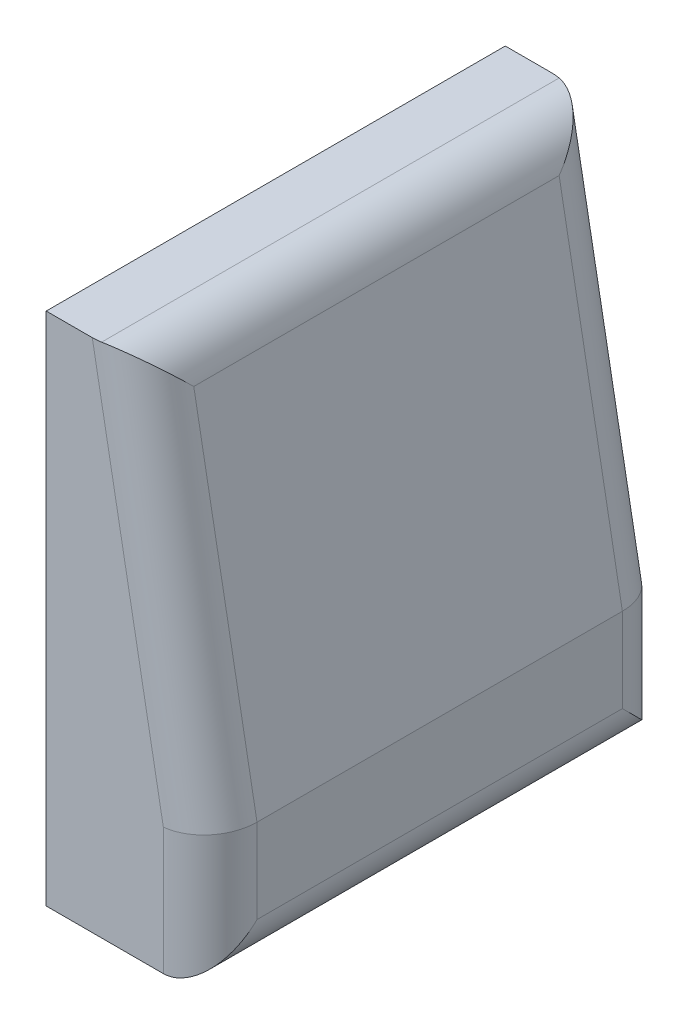
ISO-10303-21;
HEADER;
FILE_DESCRIPTION(('STEP AP214'),'2;1');
FILE_NAME('part.step','',(''),(''),'','','');
FILE_SCHEMA(('AUTOMOTIVE_DESIGN { 1 0 10303 214 1 1 1 1 }'));
ENDSEC;
DATA;
#1=APPLICATION_CONTEXT('core data for automotive mechanical design processes');
#2=APPLICATION_PROTOCOL_DEFINITION('international standard','automotive_design',2000,#1);
#3=PRODUCT_CONTEXT('',#1,'mechanical');
#4=PRODUCT('Part','Part','',(#3));
#5=PRODUCT_RELATED_PRODUCT_CATEGORY('part','',(#4));
#6=PRODUCT_DEFINITION_FORMATION('','',#4);
#7=PRODUCT_DEFINITION_CONTEXT('part definition',#1,'design');
#8=PRODUCT_DEFINITION('design','',#6,#7);
#9=PRODUCT_DEFINITION_SHAPE('','',#8);
#10=(LENGTH_UNIT() NAMED_UNIT(*) SI_UNIT(.MILLI.,.METRE.));
#11=(NAMED_UNIT(*) PLANE_ANGLE_UNIT() SI_UNIT($,.RADIAN.));
#12=(NAMED_UNIT(*) SI_UNIT($,.STERADIAN.) SOLID_ANGLE_UNIT());
#13=UNCERTAINTY_MEASURE_WITH_UNIT(LENGTH_MEASURE(1.E-05),#10,'distance_accuracy_value','');
#14=(GEOMETRIC_REPRESENTATION_CONTEXT(3) GLOBAL_UNCERTAINTY_ASSIGNED_CONTEXT((#13)) GLOBAL_UNIT_ASSIGNED_CONTEXT((#10,
#11,#12)) REPRESENTATION_CONTEXT('',''));
#15=CARTESIAN_POINT('',(0.,0.,0.));
#16=DIRECTION('',(0.,0.,1.));
#17=DIRECTION('',(1.,0.,0.));
#18=AXIS2_PLACEMENT_3D('',#15,#16,#17);
#19=CARTESIAN_POINT('',(350.,0.,490.));
#20=DIRECTION('',(0.,1.,0.));
#21=DIRECTION('',(-1.,0.,0.));
#22=AXIS2_PLACEMENT_3D('',#19,#20,#21);
#23=PLANE('',#22);
#24=DIRECTION('',(1.,0.,0.));
#25=VECTOR('',#24,1.);
#26=CARTESIAN_POINT('',(350.,0.,-490.));
#27=LINE('',#26,#25);
#28=CARTESIAN_POINT('',(0.,0.,-490.));
#29=VERTEX_POINT('',#28);
#30=CARTESIAN_POINT('',(250.,0.,-490.));
#31=VERTEX_POINT('',#30);
#32=EDGE_CURVE('E146',#29,#31,#27,.T.);
#33=ORIENTED_EDGE('',*,*,#32,.T.);
#34=DIRECTION('',(0.,0.,-1.));
#35=VECTOR('',#34,1.);
#36=CARTESIAN_POINT('',(250.,0.,490.));
#37=LINE('',#36,#35);
#38=CARTESIAN_POINT('',(250.,0.,490.));
#39=VERTEX_POINT('',#38);
#40=EDGE_CURVE('E168',#31,#39,#37,.F.);
#41=ORIENTED_EDGE('',*,*,#40,.T.);
#42=DIRECTION('',(1.,0.,0.));
#43=VECTOR('',#42,1.);
#44=CARTESIAN_POINT('',(350.,0.,490.));
#45=LINE('',#44,#43);
#46=CARTESIAN_POINT('',(0.,0.,490.));
#47=VERTEX_POINT('',#46);
#48=EDGE_CURVE('E125',#47,#39,#45,.T.);
#49=ORIENTED_EDGE('',*,*,#48,.F.);
#50=DIRECTION('',(0.,0.,-1.));
#51=VECTOR('',#50,1.);
#52=CARTESIAN_POINT('',(0.,0.,490.));
#53=LINE('',#52,#51);
#54=EDGE_CURVE('E135',#47,#29,#53,.T.);
#55=ORIENTED_EDGE('',*,*,#54,.T.);
#56=EDGE_LOOP('',(#33,#41,#49,#55));
#57=FACE_BOUND('',#56,.T.);
#58=ADVANCED_FACE('F41',(#57),#23,.F.);
#59=CARTESIAN_POINT('',(350.,280.,490.));
#60=DIRECTION('',(-1.,0.,0.));
#61=DIRECTION('',(0.,0.,1.));
#62=AXIS2_PLACEMENT_3D('',#59,#60,#61);
#63=PLANE('',#62);
#64=DIRECTION('',(0.,0.,-1.));
#65=VECTOR('',#64,1.);
#66=CARTESIAN_POINT('',(350.,280.,490.));
#67=LINE('',#66,#65);
#68=CARTESIAN_POINT('',(350.,280.,390.));
#69=VERTEX_POINT('',#68);
#70=CARTESIAN_POINT('',(350.,280.,-390.));
#71=VERTEX_POINT('',#70);
#72=EDGE_CURVE('E134',#69,#71,#67,.T.);
#73=ORIENTED_EDGE('',*,*,#72,.F.);
#74=DIRECTION('',(0.,1.,0.));
#75=VECTOR('',#74,1.);
#76=CARTESIAN_POINT('',(350.,280.,390.));
#77=LINE('',#76,#75);
#78=CARTESIAN_POINT('',(350.,100.,390.));
#79=VERTEX_POINT('',#78);
#80=EDGE_CURVE('E165',#69,#79,#77,.F.);
#81=ORIENTED_EDGE('',*,*,#80,.T.);
#82=DIRECTION('',(0.,0.,-1.));
#83=VECTOR('',#82,1.);
#84=CARTESIAN_POINT('',(350.,100.,490.));
#85=LINE('',#84,#83);
#86=CARTESIAN_POINT('',(350.,100.,-390.));
#87=VERTEX_POINT('',#86);
#88=EDGE_CURVE('E161',#79,#87,#85,.T.);
#89=ORIENTED_EDGE('',*,*,#88,.T.);
#90=DIRECTION('',(0.,1.,0.));
#91=VECTOR('',#90,1.);
#92=CARTESIAN_POINT('',(350.,280.,-390.));
#93=LINE('',#92,#91);
#94=EDGE_CURVE('E158',#87,#71,#93,.T.);
#95=ORIENTED_EDGE('',*,*,#94,.T.);
#96=EDGE_LOOP('',(#73,#81,#89,#95));
#97=FACE_BOUND('',#96,.T.);
#98=ADVANCED_FACE('F244',(#97),#63,.F.);
#99=CARTESIAN_POINT('',(200.,1100.,490.));
#100=DIRECTION('',(-0.983677406707226,-0.17994098903181,0.));
#101=DIRECTION('',(0.17994098903181,-0.983677406707226,0.));
#102=AXIS2_PLACEMENT_3D('',#99,#100,#101);
#103=PLANE('',#102);
#104=DIRECTION('',(0.,0.,-1.));
#105=VECTOR('',#104,1.);
#106=CARTESIAN_POINT('',(215.00107946893,1017.99409890318,490.));
#107=LINE('',#106,#105);
#108=CARTESIAN_POINT('',(215.00107946893,1017.99409890318,-390.));
#109=VERTEX_POINT('',#108);
#110=CARTESIAN_POINT('',(215.00107946893,1017.99409890318,390.));
#111=VERTEX_POINT('',#110);
#112=EDGE_CURVE('E65',#109,#111,#107,.F.);
#113=ORIENTED_EDGE('',*,*,#112,.T.);
#114=DIRECTION('',(-0.17994098903181,0.983677406707226,0.));
#115=VECTOR('',#114,1.);
#116=CARTESIAN_POINT('',(200.,1100.,390.));
#117=LINE('',#116,#115);
#118=EDGE_CURVE('E191',#111,#69,#117,.F.);
#119=ORIENTED_EDGE('',*,*,#118,.T.);
#120=ORIENTED_EDGE('',*,*,#72,.T.);
#121=DIRECTION('',(-0.17994098903181,0.983677406707226,0.));
#122=VECTOR('',#121,1.);
#123=CARTESIAN_POINT('',(200.,1100.,-390.));
#124=LINE('',#123,#122);
#125=EDGE_CURVE('E186',#71,#109,#124,.T.);
#126=ORIENTED_EDGE('',*,*,#125,.T.);
#127=EDGE_LOOP('',(#113,#119,#120,#126));
#128=FACE_BOUND('',#127,.T.);
#129=ADVANCED_FACE('F245',(#128),#103,.F.);
#130=CARTESIAN_POINT('',(0.,1100.,490.));
#131=DIRECTION('',(0.,-1.,0.));
#132=DIRECTION('',(0.,0.,-1.));
#133=AXIS2_PLACEMENT_3D('',#130,#131,#132);
#134=PLANE('',#133);
#135=DIRECTION('',(-1.,0.,0.));
#136=VECTOR('',#135,1.);
#137=CARTESIAN_POINT('',(0.,1100.,490.));
#138=LINE('',#137,#136);
#139=CARTESIAN_POINT('',(98.3406558713784,1100.,490.));
#140=VERTEX_POINT('',#139);
#141=CARTESIAN_POINT('',(0.,1100.,490.));
#142=VERTEX_POINT('',#141);
#143=EDGE_CURVE('E113',#140,#142,#138,.T.);
#144=ORIENTED_EDGE('',*,*,#143,.F.);
#145=CARTESIAN_POINT('',(98.3406558713784,1100.,390.));
#146=DIRECTION('',(0.,-1.,0.));
#147=DIRECTION('',(-1.,0.,0.));
#148=AXIS2_PLACEMENT_3D('',#145,#146,#147);
#149=ELLIPSE('',#148,101.659344128622,100.);
#150=CARTESIAN_POINT('',(116.633338798208,1100.,488.367740670723));
#151=VERTEX_POINT('',#150);
#152=EDGE_CURVE('E183',#140,#151,#149,.F.);
#153=ORIENTED_EDGE('',*,*,#152,.T.);
#154=DIRECTION('',(0.,0.,-1.));
#155=VECTOR('',#154,1.);
#156=CARTESIAN_POINT('',(116.633338798208,1100.,490.));
#157=LINE('',#156,#155);
#158=CARTESIAN_POINT('',(116.633338798208,1100.,-488.367740670723));
#159=VERTEX_POINT('',#158);
#160=EDGE_CURVE('E180',#151,#159,#157,.T.);
#161=ORIENTED_EDGE('',*,*,#160,.T.);
#162=CARTESIAN_POINT('',(98.3406558713784,1100.,-390.));
#163=DIRECTION('',(0.,-1.,0.));
#164=DIRECTION('',(1.,0.,0.));
#165=AXIS2_PLACEMENT_3D('',#162,#163,#164);
#166=ELLIPSE('',#165,101.659344128622,100.);
#167=CARTESIAN_POINT('',(98.3406558713784,1100.,-490.));
#168=VERTEX_POINT('',#167);
#169=EDGE_CURVE('E177',#159,#168,#166,.F.);
#170=ORIENTED_EDGE('',*,*,#169,.T.);
#171=DIRECTION('',(-1.,0.,0.));
#172=VECTOR('',#171,1.);
#173=CARTESIAN_POINT('',(0.,1100.,-490.));
#174=LINE('',#173,#172);
#175=CARTESIAN_POINT('',(0.,1100.,-490.));
#176=VERTEX_POINT('',#175);
#177=EDGE_CURVE('E130',#168,#176,#174,.T.);
#178=ORIENTED_EDGE('',*,*,#177,.T.);
#179=DIRECTION('',(0.,0.,-1.));
#180=VECTOR('',#179,1.);
#181=CARTESIAN_POINT('',(0.,1100.,490.));
#182=LINE('',#181,#180);
#183=EDGE_CURVE('E128',#142,#176,#182,.T.);
#184=ORIENTED_EDGE('',*,*,#183,.F.);
#185=EDGE_LOOP('',(#144,#153,#161,#170,#178,#184));
#186=FACE_BOUND('',#185,.T.);
#187=ADVANCED_FACE('F129',(#186),#134,.F.);
#188=CARTESIAN_POINT('',(0.,0.,490.));
#189=DIRECTION('',(1.,0.,0.));
#190=DIRECTION('',(0.,0.,-1.));
#191=AXIS2_PLACEMENT_3D('',#188,#189,#190);
#192=PLANE('',#191);
#193=DIRECTION('',(0.,-1.,0.));
#194=VECTOR('',#193,1.);
#195=CARTESIAN_POINT('',(0.,0.,-490.));
#196=LINE('',#195,#194);
#197=EDGE_CURVE('E152',#176,#29,#196,.T.);
#198=ORIENTED_EDGE('',*,*,#197,.T.);
#199=ORIENTED_EDGE('',*,*,#54,.F.);
#200=DIRECTION('',(0.,-1.,0.));
#201=VECTOR('',#200,1.);
#202=CARTESIAN_POINT('',(0.,0.,490.));
#203=LINE('',#202,#201);
#204=EDGE_CURVE('E118',#142,#47,#203,.T.);
#205=ORIENTED_EDGE('',*,*,#204,.F.);
#206=ORIENTED_EDGE('',*,*,#183,.T.);
#207=EDGE_LOOP('',(#198,#199,#205,#206));
#208=FACE_BOUND('',#207,.T.);
#209=ADVANCED_FACE('F137',(#208),#192,.F.);
#210=CARTESIAN_POINT('',(0.,0.,490.));
#211=DIRECTION('',(0.,0.,-1.));
#212=DIRECTION('',(-1.,0.,0.));
#213=AXIS2_PLACEMENT_3D('',#210,#211,#212);
#214=PLANE('',#213);
#215=DIRECTION('',(0.,1.,0.));
#216=VECTOR('',#215,1.);
#217=CARTESIAN_POINT('',(250.,0.,490.));
#218=LINE('',#217,#216);
#219=CARTESIAN_POINT('',(250.,270.928918763536,490.));
#220=VERTEX_POINT('',#219);
#221=EDGE_CURVE('E172',#39,#220,#218,.T.);
#222=ORIENTED_EDGE('',*,*,#221,.T.);
#223=DIRECTION('',(-0.17994098903181,0.983677406707226,0.));
#224=VECTOR('',#223,1.);
#225=CARTESIAN_POINT('',(289.860781418787,53.0233136741683,490.));
#226=LINE('',#225,#224);
#227=EDGE_CURVE('E121',#220,#140,#226,.T.);
#228=ORIENTED_EDGE('',*,*,#227,.T.);
#229=ORIENTED_EDGE('',*,*,#143,.T.);
#230=ORIENTED_EDGE('',*,*,#204,.T.);
#231=ORIENTED_EDGE('',*,*,#48,.T.);
#232=EDGE_LOOP('',(#222,#228,#229,#230,#231));
#233=FACE_BOUND('',#232,.T.);
#234=ADVANCED_FACE('F115',(#233),#214,.F.);
#235=CARTESIAN_POINT('',(0.,0.,-490.));
#236=DIRECTION('',(0.,0.,-1.));
#237=DIRECTION('',(-1.,0.,0.));
#238=AXIS2_PLACEMENT_3D('',#235,#236,#237);
#239=PLANE('',#238);
#240=ORIENTED_EDGE('',*,*,#177,.F.);
#241=DIRECTION('',(-0.17994098903181,0.983677406707226,0.));
#242=VECTOR('',#241,1.);
#243=CARTESIAN_POINT('',(251.632259329277,262.005901096819,-490.));
#244=LINE('',#243,#242);
#245=CARTESIAN_POINT('',(250.,270.928918763535,-490.));
#246=VERTEX_POINT('',#245);
#247=EDGE_CURVE('E11',#168,#246,#244,.F.);
#248=ORIENTED_EDGE('',*,*,#247,.T.);
#249=DIRECTION('',(0.,1.,0.));
#250=VECTOR('',#249,1.);
#251=CARTESIAN_POINT('',(250.,0.,-490.));
#252=LINE('',#251,#250);
#253=EDGE_CURVE('E51',#246,#31,#252,.F.);
#254=ORIENTED_EDGE('',*,*,#253,.T.);
#255=ORIENTED_EDGE('',*,*,#32,.F.);
#256=ORIENTED_EDGE('',*,*,#197,.F.);
#257=EDGE_LOOP('',(#240,#248,#254,#255,#256));
#258=FACE_BOUND('',#257,.T.);
#259=ADVANCED_FACE('F224',(#258),#239,.T.);
#260=CARTESIAN_POINT('',(116.633338798208,1000.,490.));
#261=DIRECTION('',(0.,0.,-1.));
#262=DIRECTION('',(-1.,0.,0.));
#263=AXIS2_PLACEMENT_3D('',#260,#261,#262);
#264=CYLINDRICAL_SURFACE('',#263,100.);
#265=CARTESIAN_POINT('',(116.633338798208,1000.,-390.));
#266=DIRECTION('',(0.127237493557807,-0.695564964782677,-0.707106781186547));
#267=DIRECTION('',(0.127237493557807,-0.695564964782677,0.707106781186547));
#268=AXIS2_PLACEMENT_3D('',#265,#266,#267);
#269=ELLIPSE('',#268,141.42135623731,100.);
#270=EDGE_CURVE('E209',#159,#109,#269,.T.);
#271=ORIENTED_EDGE('',*,*,#270,.F.);
#272=ORIENTED_EDGE('',*,*,#160,.F.);
#273=CARTESIAN_POINT('',(116.633338798208,1000.,390.));
#274=DIRECTION('',(-0.127237493557807,0.695564964782677,-0.707106781186547));
#275=DIRECTION('',(0.127237493557807,-0.695564964782677,-0.707106781186547));
#276=AXIS2_PLACEMENT_3D('',#273,#274,#275);
#277=ELLIPSE('',#276,141.42135623731,100.);
#278=EDGE_CURVE('E45',#111,#151,#277,.F.);
#279=ORIENTED_EDGE('',*,*,#278,.F.);
#280=ORIENTED_EDGE('',*,*,#112,.F.);
#281=EDGE_LOOP('',(#271,#272,#279,#280));
#282=FACE_BOUND('',#281,.T.);
#283=ADVANCED_FACE('F43',(#282),#264,.T.);
#284=CARTESIAN_POINT('',(289.860781418787,53.0233136741683,390.));
#285=DIRECTION('',(-0.17994098903181,0.983677406707226,0.));
#286=DIRECTION('',(-0.983677406707226,-0.17994098903181,0.));
#287=AXIS2_PLACEMENT_3D('',#284,#285,#286);
#288=CYLINDRICAL_SURFACE('',#287,100.);
#289=ORIENTED_EDGE('',*,*,#152,.F.);
#290=ORIENTED_EDGE('',*,*,#227,.F.);
#291=CARTESIAN_POINT('',(250.,270.928918763536,390.));
#292=DIRECTION('',(-0.0903398950983827,0.995910991682296,0.));
#293=DIRECTION('',(0.995910991682295,0.0903398950983824,0.));
#294=AXIS2_PLACEMENT_3D('',#291,#292,#293);
#295=ELLIPSE('',#294,100.410579695561,100.);
#296=EDGE_CURVE('E206',#69,#220,#295,.F.);
#297=ORIENTED_EDGE('',*,*,#296,.F.);
#298=ORIENTED_EDGE('',*,*,#118,.F.);
#299=ORIENTED_EDGE('',*,*,#278,.T.);
#300=EDGE_LOOP('',(#289,#290,#297,#298,#299));
#301=FACE_BOUND('',#300,.T.);
#302=ADVANCED_FACE('F220',(#301),#288,.T.);
#303=CARTESIAN_POINT('',(101.632259329277,1082.00590109682,-390.));
#304=DIRECTION('',(0.17994098903181,-0.983677406707226,0.));
#305=DIRECTION('',(0.983677406707226,0.17994098903181,0.));
#306=AXIS2_PLACEMENT_3D('',#303,#304,#305);
#307=CYLINDRICAL_SURFACE('',#306,100.);
#308=ORIENTED_EDGE('',*,*,#270,.T.);
#309=ORIENTED_EDGE('',*,*,#125,.F.);
#310=CARTESIAN_POINT('',(250.,270.928918763531,-390.));
#311=DIRECTION('',(0.0903398950983827,-0.995910991682296,0.));
#312=DIRECTION('',(-0.995910991682295,-0.0903398950983824,0.));
#313=AXIS2_PLACEMENT_3D('',#310,#311,#312);
#314=ELLIPSE('',#313,100.410579695561,100.);
#315=EDGE_CURVE('E202',#246,#71,#314,.T.);
#316=ORIENTED_EDGE('',*,*,#315,.F.);
#317=ORIENTED_EDGE('',*,*,#247,.F.);
#318=ORIENTED_EDGE('',*,*,#169,.F.);
#319=EDGE_LOOP('',(#308,#309,#316,#317,#318));
#320=FACE_BOUND('',#319,.T.);
#321=ADVANCED_FACE('F226',(#320),#307,.T.);
#322=CARTESIAN_POINT('',(250.,0.,390.));
#323=DIRECTION('',(0.,1.,0.));
#324=DIRECTION('',(0.,0.,1.));
#325=AXIS2_PLACEMENT_3D('',#322,#323,#324);
#326=CYLINDRICAL_SURFACE('',#325,100.);
#327=ORIENTED_EDGE('',*,*,#296,.T.);
#328=ORIENTED_EDGE('',*,*,#221,.F.);
#329=CARTESIAN_POINT('',(250.,100.,390.));
#330=DIRECTION('',(0.,0.707106781186547,0.707106781186547));
#331=DIRECTION('',(0.,0.707106781186547,-0.707106781186547));
#332=AXIS2_PLACEMENT_3D('',#329,#330,#331);
#333=ELLIPSE('',#332,141.42135623731,100.);
#334=EDGE_CURVE('E199',#79,#39,#333,.F.);
#335=ORIENTED_EDGE('',*,*,#334,.F.);
#336=ORIENTED_EDGE('',*,*,#80,.F.);
#337=EDGE_LOOP('',(#327,#328,#335,#336));
#338=FACE_BOUND('',#337,.T.);
#339=ADVANCED_FACE('F241',(#338),#326,.T.);
#340=CARTESIAN_POINT('',(250.,280.,-390.));
#341=DIRECTION('',(0.,-1.,0.));
#342=DIRECTION('',(0.,0.,-1.));
#343=AXIS2_PLACEMENT_3D('',#340,#341,#342);
#344=CYLINDRICAL_SURFACE('',#343,100.);
#345=ORIENTED_EDGE('',*,*,#315,.T.);
#346=ORIENTED_EDGE('',*,*,#94,.F.);
#347=CARTESIAN_POINT('',(250.,100.,-390.));
#348=DIRECTION('',(0.,-0.707106781186547,0.707106781186547));
#349=DIRECTION('',(0.,-0.707106781186547,-0.707106781186547));
#350=AXIS2_PLACEMENT_3D('',#347,#348,#349);
#351=ELLIPSE('',#350,141.42135623731,100.);
#352=EDGE_CURVE('E196',#31,#87,#351,.T.);
#353=ORIENTED_EDGE('',*,*,#352,.F.);
#354=ORIENTED_EDGE('',*,*,#253,.F.);
#355=EDGE_LOOP('',(#345,#346,#353,#354));
#356=FACE_BOUND('',#355,.T.);
#357=ADVANCED_FACE('F231',(#356),#344,.T.);
#358=CARTESIAN_POINT('',(250.,100.,490.));
#359=DIRECTION('',(0.,0.,-1.));
#360=DIRECTION('',(-1.,0.,0.));
#361=AXIS2_PLACEMENT_3D('',#358,#359,#360);
#362=CYLINDRICAL_SURFACE('',#361,100.);
#363=ORIENTED_EDGE('',*,*,#334,.T.);
#364=ORIENTED_EDGE('',*,*,#40,.F.);
#365=ORIENTED_EDGE('',*,*,#352,.T.);
#366=ORIENTED_EDGE('',*,*,#88,.F.);
#367=EDGE_LOOP('',(#363,#364,#365,#366));
#368=FACE_BOUND('',#367,.T.);
#369=ADVANCED_FACE('F235',(#368),#362,.T.);
#370=CLOSED_SHELL('',(#58,#98,#129,#187,#209,#234,#259,#283,#302,#321,#339,#357,#369));
#371=MANIFOLD_SOLID_BREP('B2',#370);
#372=ADVANCED_BREP_SHAPE_REPRESENTATION('',(#18,#371),#14);
#373=SHAPE_DEFINITION_REPRESENTATION(#9,#372);
ENDSEC;
END-ISO-10303-21;
